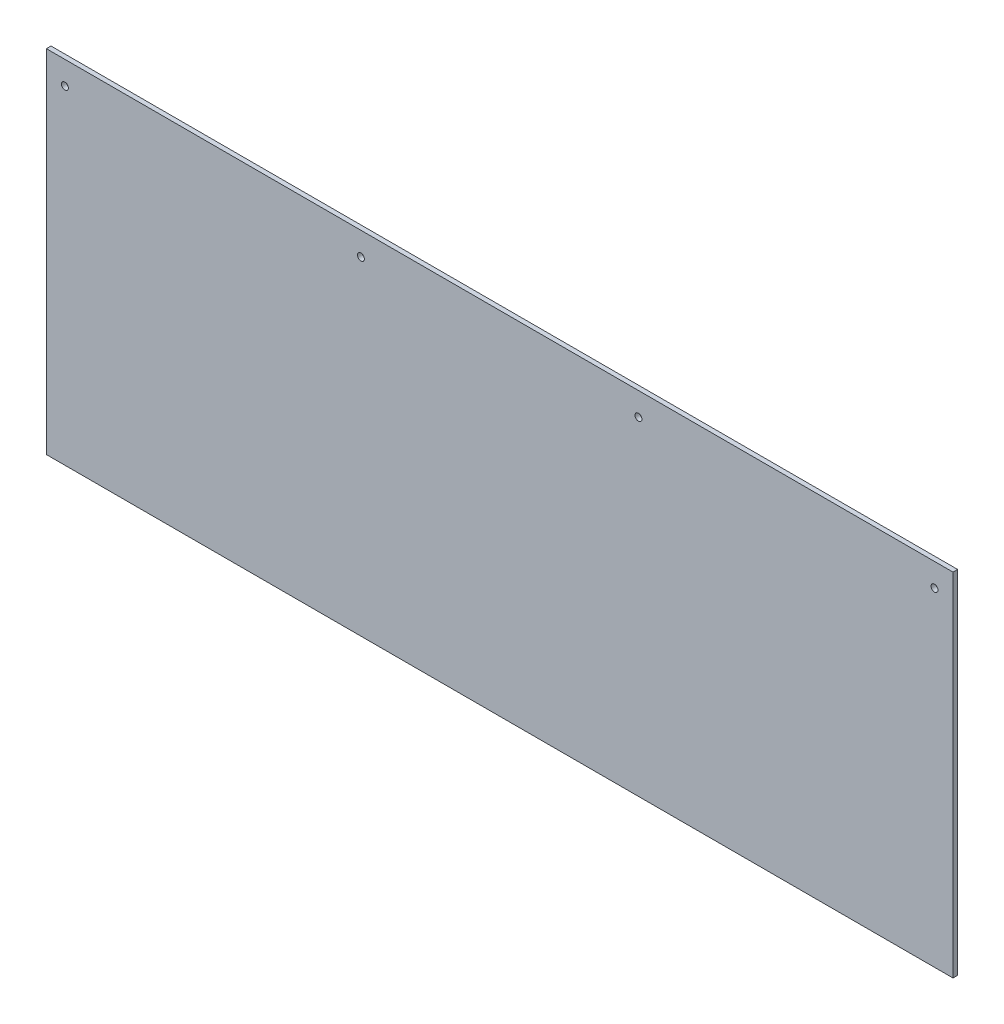
ISO-10303-21;
HEADER;
FILE_DESCRIPTION(('STEP AP214'),'2;1');
FILE_NAME('part.step','',(''),(''),'','','');
FILE_SCHEMA(('AUTOMOTIVE_DESIGN { 1 0 10303 214 1 1 1 1 }'));
ENDSEC;
DATA;
#1=APPLICATION_CONTEXT('core data for automotive mechanical design processes');
#2=APPLICATION_PROTOCOL_DEFINITION('international standard','automotive_design',2000,#1);
#3=PRODUCT_CONTEXT('',#1,'mechanical');
#4=PRODUCT('Part','Part','',(#3));
#5=PRODUCT_RELATED_PRODUCT_CATEGORY('part','',(#4));
#6=PRODUCT_DEFINITION_FORMATION('','',#4);
#7=PRODUCT_DEFINITION_CONTEXT('part definition',#1,'design');
#8=PRODUCT_DEFINITION('design','',#6,#7);
#9=PRODUCT_DEFINITION_SHAPE('','',#8);
#10=(LENGTH_UNIT() NAMED_UNIT(*) SI_UNIT(.MILLI.,.METRE.));
#11=(NAMED_UNIT(*) PLANE_ANGLE_UNIT() SI_UNIT($,.RADIAN.));
#12=(NAMED_UNIT(*) SI_UNIT($,.STERADIAN.) SOLID_ANGLE_UNIT());
#13=UNCERTAINTY_MEASURE_WITH_UNIT(LENGTH_MEASURE(1.E-05),#10,'distance_accuracy_value','');
#14=(GEOMETRIC_REPRESENTATION_CONTEXT(3) GLOBAL_UNCERTAINTY_ASSIGNED_CONTEXT((#13)) GLOBAL_UNIT_ASSIGNED_CONTEXT((#10,
#11,#12)) REPRESENTATION_CONTEXT('',''));
#15=CARTESIAN_POINT('',(0.,0.,0.));
#16=DIRECTION('',(0.,0.,1.));
#17=DIRECTION('',(1.,0.,0.));
#18=AXIS2_PLACEMENT_3D('',#15,#16,#17);
#19=CARTESIAN_POINT('',(0.,0.,6.35));
#20=DIRECTION('',(1.,0.,0.));
#21=DIRECTION('',(0.,0.,-1.));
#22=AXIS2_PLACEMENT_3D('',#19,#20,#21);
#23=PLANE('',#22);
#24=DIRECTION('',(0.,-1.,0.));
#25=VECTOR('',#24,1.);
#26=CARTESIAN_POINT('',(0.,0.,0.));
#27=LINE('',#26,#25);
#28=CARTESIAN_POINT('',(0.,482.6,0.));
#29=VERTEX_POINT('',#28);
#30=CARTESIAN_POINT('',(0.,0.,0.));
#31=VERTEX_POINT('',#30);
#32=EDGE_CURVE('E100',#29,#31,#27,.T.);
#33=ORIENTED_EDGE('',*,*,#32,.T.);
#34=DIRECTION('',(0.,0.,-1.));
#35=VECTOR('',#34,1.);
#36=CARTESIAN_POINT('',(0.,0.,6.35));
#37=LINE('',#36,#35);
#38=CARTESIAN_POINT('',(0.,0.,6.35));
#39=VERTEX_POINT('',#38);
#40=EDGE_CURVE('E11',#39,#31,#37,.T.);
#41=ORIENTED_EDGE('',*,*,#40,.F.);
#42=DIRECTION('',(0.,-1.,0.));
#43=VECTOR('',#42,1.);
#44=CARTESIAN_POINT('',(0.,0.,6.35));
#45=LINE('',#44,#43);
#46=CARTESIAN_POINT('',(0.,482.6,6.35));
#47=VERTEX_POINT('',#46);
#48=EDGE_CURVE('E88',#47,#39,#45,.T.);
#49=ORIENTED_EDGE('',*,*,#48,.F.);
#50=DIRECTION('',(0.,0.,-1.));
#51=VECTOR('',#50,1.);
#52=CARTESIAN_POINT('',(0.,482.6,6.35));
#53=LINE('',#52,#51);
#54=EDGE_CURVE('E96',#47,#29,#53,.T.);
#55=ORIENTED_EDGE('',*,*,#54,.T.);
#56=EDGE_LOOP('',(#33,#41,#49,#55));
#57=FACE_BOUND('',#56,.T.);
#58=ADVANCED_FACE('F37',(#57),#23,.F.);
#59=CARTESIAN_POINT('',(0.,0.,6.35));
#60=DIRECTION('',(0.,1.,0.));
#61=DIRECTION('',(0.,0.,1.));
#62=AXIS2_PLACEMENT_3D('',#59,#60,#61);
#63=PLANE('',#62);
#64=DIRECTION('',(1.,0.,0.));
#65=VECTOR('',#64,1.);
#66=CARTESIAN_POINT('',(0.,0.,0.));
#67=LINE('',#66,#65);
#68=CARTESIAN_POINT('',(1244.6,0.,0.));
#69=VERTEX_POINT('',#68);
#70=EDGE_CURVE('E92',#31,#69,#67,.T.);
#71=ORIENTED_EDGE('',*,*,#70,.T.);
#72=DIRECTION('',(0.,0.,-1.));
#73=VECTOR('',#72,1.);
#74=CARTESIAN_POINT('',(1244.6,0.,6.35));
#75=LINE('',#74,#73);
#76=CARTESIAN_POINT('',(1244.6,0.,6.35));
#77=VERTEX_POINT('',#76);
#78=EDGE_CURVE('E45',#77,#69,#75,.T.);
#79=ORIENTED_EDGE('',*,*,#78,.F.);
#80=DIRECTION('',(1.,0.,0.));
#81=VECTOR('',#80,1.);
#82=CARTESIAN_POINT('',(0.,0.,6.35));
#83=LINE('',#82,#81);
#84=EDGE_CURVE('E83',#39,#77,#83,.T.);
#85=ORIENTED_EDGE('',*,*,#84,.F.);
#86=ORIENTED_EDGE('',*,*,#40,.T.);
#87=EDGE_LOOP('',(#71,#79,#85,#86));
#88=FACE_BOUND('',#87,.T.);
#89=ADVANCED_FACE('F91',(#88),#63,.F.);
#90=CARTESIAN_POINT('',(1244.6,0.,6.35));
#91=DIRECTION('',(-1.,0.,0.));
#92=DIRECTION('',(0.,0.,1.));
#93=AXIS2_PLACEMENT_3D('',#90,#91,#92);
#94=PLANE('',#93);
#95=DIRECTION('',(0.,1.,0.));
#96=VECTOR('',#95,1.);
#97=CARTESIAN_POINT('',(1244.6,0.,0.));
#98=LINE('',#97,#96);
#99=CARTESIAN_POINT('',(1244.6,482.6,0.));
#100=VERTEX_POINT('',#99);
#101=EDGE_CURVE('E70',#69,#100,#98,.T.);
#102=ORIENTED_EDGE('',*,*,#101,.T.);
#103=DIRECTION('',(0.,0.,-1.));
#104=VECTOR('',#103,1.);
#105=CARTESIAN_POINT('',(1244.6,482.6,6.35));
#106=LINE('',#105,#104);
#107=CARTESIAN_POINT('',(1244.6,482.6,6.35));
#108=VERTEX_POINT('',#107);
#109=EDGE_CURVE('E93',#108,#100,#106,.T.);
#110=ORIENTED_EDGE('',*,*,#109,.F.);
#111=DIRECTION('',(0.,1.,0.));
#112=VECTOR('',#111,1.);
#113=CARTESIAN_POINT('',(1244.6,0.,6.35));
#114=LINE('',#113,#112);
#115=EDGE_CURVE('E86',#77,#108,#114,.T.);
#116=ORIENTED_EDGE('',*,*,#115,.F.);
#117=ORIENTED_EDGE('',*,*,#78,.T.);
#118=EDGE_LOOP('',(#102,#110,#116,#117));
#119=FACE_BOUND('',#118,.T.);
#120=ADVANCED_FACE('F94',(#119),#94,.F.);
#121=CARTESIAN_POINT('',(0.,482.6,6.35));
#122=DIRECTION('',(0.,-1.,0.));
#123=DIRECTION('',(1.,0.,0.));
#124=AXIS2_PLACEMENT_3D('',#121,#122,#123);
#125=PLANE('',#124);
#126=DIRECTION('',(-1.,0.,0.));
#127=VECTOR('',#126,1.);
#128=CARTESIAN_POINT('',(0.,482.6,0.));
#129=LINE('',#128,#127);
#130=EDGE_CURVE('E76',#100,#29,#129,.T.);
#131=ORIENTED_EDGE('',*,*,#130,.T.);
#132=ORIENTED_EDGE('',*,*,#54,.F.);
#133=DIRECTION('',(-1.,0.,0.));
#134=VECTOR('',#133,1.);
#135=CARTESIAN_POINT('',(0.,482.6,6.35));
#136=LINE('',#135,#134);
#137=EDGE_CURVE('E53',#108,#47,#136,.T.);
#138=ORIENTED_EDGE('',*,*,#137,.F.);
#139=ORIENTED_EDGE('',*,*,#109,.T.);
#140=EDGE_LOOP('',(#131,#132,#138,#139));
#141=FACE_BOUND('',#140,.T.);
#142=ADVANCED_FACE('F108',(#141),#125,.F.);
#143=CARTESIAN_POINT('',(0.,0.,6.35));
#144=DIRECTION('',(0.,0.,-1.));
#145=DIRECTION('',(-1.,0.,0.));
#146=AXIS2_PLACEMENT_3D('',#143,#144,#145);
#147=PLANE('',#146);
#148=CARTESIAN_POINT('',(25.4,450.85,6.35));
#149=DIRECTION('',(0.,0.,1.));
#150=DIRECTION('',(1.,0.,0.));
#151=AXIS2_PLACEMENT_3D('',#148,#149,#150);
#152=CIRCLE('',#151,4.7625);
#153=CARTESIAN_POINT('',(30.1625,450.85,6.35));
#154=VERTEX_POINT('',#153);
#155=EDGE_CURVE('E132',#154,#154,#152,.T.);
#156=ORIENTED_EDGE('',*,*,#155,.F.);
#157=EDGE_LOOP('',(#156));
#158=FACE_BOUND('',#157,.T.);
#159=CARTESIAN_POINT('',(431.8,450.85,6.35));
#160=DIRECTION('',(0.,0.,1.));
#161=DIRECTION('',(1.,0.,0.));
#162=AXIS2_PLACEMENT_3D('',#159,#160,#161);
#163=CIRCLE('',#162,4.76250000000001);
#164=CARTESIAN_POINT('',(436.5625,450.85,6.35));
#165=VERTEX_POINT('',#164);
#166=EDGE_CURVE('E126',#165,#165,#163,.T.);
#167=ORIENTED_EDGE('',*,*,#166,.F.);
#168=EDGE_LOOP('',(#167));
#169=FACE_BOUND('',#168,.T.);
#170=CARTESIAN_POINT('',(812.8,450.85,6.35));
#171=DIRECTION('',(0.,0.,1.));
#172=DIRECTION('',(1.,0.,0.));
#173=AXIS2_PLACEMENT_3D('',#170,#171,#172);
#174=CIRCLE('',#173,4.76250000000001);
#175=CARTESIAN_POINT('',(817.5625,450.85,6.35));
#176=VERTEX_POINT('',#175);
#177=EDGE_CURVE('E120',#176,#176,#174,.T.);
#178=ORIENTED_EDGE('',*,*,#177,.F.);
#179=EDGE_LOOP('',(#178));
#180=FACE_BOUND('',#179,.T.);
#181=CARTESIAN_POINT('',(1219.2,450.85,6.35));
#182=DIRECTION('',(0.,0.,1.));
#183=DIRECTION('',(1.,0.,0.));
#184=AXIS2_PLACEMENT_3D('',#181,#182,#183);
#185=CIRCLE('',#184,4.7624999999999);
#186=CARTESIAN_POINT('',(1223.9625,450.85,6.35));
#187=VERTEX_POINT('',#186);
#188=EDGE_CURVE('E114',#187,#187,#185,.T.);
#189=ORIENTED_EDGE('',*,*,#188,.F.);
#190=EDGE_LOOP('',(#189));
#191=FACE_BOUND('',#190,.T.);
#192=ORIENTED_EDGE('',*,*,#48,.T.);
#193=ORIENTED_EDGE('',*,*,#84,.T.);
#194=ORIENTED_EDGE('',*,*,#115,.T.);
#195=ORIENTED_EDGE('',*,*,#137,.T.);
#196=EDGE_LOOP('',(#192,#193,#194,#195));
#197=FACE_BOUND('',#196,.T.);
#198=ADVANCED_FACE('F84',(#158,#169,#180,#191,#197),#147,.F.);
#199=CARTESIAN_POINT('',(0.,0.,0.));
#200=DIRECTION('',(0.,0.,-1.));
#201=DIRECTION('',(-1.,0.,0.));
#202=AXIS2_PLACEMENT_3D('',#199,#200,#201);
#203=PLANE('',#202);
#204=CARTESIAN_POINT('',(25.4,450.85,0.));
#205=DIRECTION('',(0.,0.,1.));
#206=DIRECTION('',(1.,0.,0.));
#207=AXIS2_PLACEMENT_3D('',#204,#205,#206);
#208=CIRCLE('',#207,4.7625);
#209=CARTESIAN_POINT('',(30.1625,450.85,0.));
#210=VERTEX_POINT('',#209);
#211=EDGE_CURVE('E103',#210,#210,#208,.T.);
#212=ORIENTED_EDGE('',*,*,#211,.T.);
#213=EDGE_LOOP('',(#212));
#214=FACE_BOUND('',#213,.T.);
#215=CARTESIAN_POINT('',(431.8,450.85,0.));
#216=DIRECTION('',(0.,0.,1.));
#217=DIRECTION('',(1.,0.,0.));
#218=AXIS2_PLACEMENT_3D('',#215,#216,#217);
#219=CIRCLE('',#218,4.76250000000001);
#220=CARTESIAN_POINT('',(436.5625,450.85,0.));
#221=VERTEX_POINT('',#220);
#222=EDGE_CURVE('E129',#221,#221,#219,.T.);
#223=ORIENTED_EDGE('',*,*,#222,.T.);
#224=EDGE_LOOP('',(#223));
#225=FACE_BOUND('',#224,.T.);
#226=CARTESIAN_POINT('',(812.8,450.85,0.));
#227=DIRECTION('',(0.,0.,1.));
#228=DIRECTION('',(1.,0.,0.));
#229=AXIS2_PLACEMENT_3D('',#226,#227,#228);
#230=CIRCLE('',#229,4.76250000000001);
#231=CARTESIAN_POINT('',(817.5625,450.85,0.));
#232=VERTEX_POINT('',#231);
#233=EDGE_CURVE('E123',#232,#232,#230,.T.);
#234=ORIENTED_EDGE('',*,*,#233,.T.);
#235=EDGE_LOOP('',(#234));
#236=FACE_BOUND('',#235,.T.);
#237=CARTESIAN_POINT('',(1219.2,450.85,0.));
#238=DIRECTION('',(0.,0.,1.));
#239=DIRECTION('',(1.,0.,0.));
#240=AXIS2_PLACEMENT_3D('',#237,#238,#239);
#241=CIRCLE('',#240,4.7624999999999);
#242=CARTESIAN_POINT('',(1223.9625,450.85,0.));
#243=VERTEX_POINT('',#242);
#244=EDGE_CURVE('E117',#243,#243,#241,.T.);
#245=ORIENTED_EDGE('',*,*,#244,.T.);
#246=EDGE_LOOP('',(#245));
#247=FACE_BOUND('',#246,.T.);
#248=ORIENTED_EDGE('',*,*,#32,.F.);
#249=ORIENTED_EDGE('',*,*,#130,.F.);
#250=ORIENTED_EDGE('',*,*,#101,.F.);
#251=ORIENTED_EDGE('',*,*,#70,.F.);
#252=EDGE_LOOP('',(#248,#249,#250,#251));
#253=FACE_BOUND('',#252,.T.);
#254=ADVANCED_FACE('F111',(#214,#225,#236,#247,#253),#203,.T.);
#255=CARTESIAN_POINT('',(1219.2,450.85,0.));
#256=DIRECTION('',(0.,0.,1.));
#257=DIRECTION('',(1.,0.,0.));
#258=AXIS2_PLACEMENT_3D('',#255,#256,#257);
#259=CYLINDRICAL_SURFACE('',#258,4.7624999999999);
#260=ORIENTED_EDGE('',*,*,#244,.F.);
#261=EDGE_LOOP('',(#260));
#262=FACE_BOUND('',#261,.T.);
#263=ORIENTED_EDGE('',*,*,#188,.T.);
#264=EDGE_LOOP('',(#263));
#265=FACE_BOUND('',#264,.T.);
#266=ADVANCED_FACE('F156',(#262,#265),#259,.F.);
#267=CARTESIAN_POINT('',(812.8,450.85,0.));
#268=DIRECTION('',(0.,0.,1.));
#269=DIRECTION('',(1.,0.,0.));
#270=AXIS2_PLACEMENT_3D('',#267,#268,#269);
#271=CYLINDRICAL_SURFACE('',#270,4.76250000000001);
#272=ORIENTED_EDGE('',*,*,#233,.F.);
#273=EDGE_LOOP('',(#272));
#274=FACE_BOUND('',#273,.T.);
#275=ORIENTED_EDGE('',*,*,#177,.T.);
#276=EDGE_LOOP('',(#275));
#277=FACE_BOUND('',#276,.T.);
#278=ADVANCED_FACE('F158',(#274,#277),#271,.F.);
#279=CARTESIAN_POINT('',(431.8,450.85,0.));
#280=DIRECTION('',(0.,0.,1.));
#281=DIRECTION('',(1.,0.,0.));
#282=AXIS2_PLACEMENT_3D('',#279,#280,#281);
#283=CYLINDRICAL_SURFACE('',#282,4.76250000000001);
#284=ORIENTED_EDGE('',*,*,#222,.F.);
#285=EDGE_LOOP('',(#284));
#286=FACE_BOUND('',#285,.T.);
#287=ORIENTED_EDGE('',*,*,#166,.T.);
#288=EDGE_LOOP('',(#287));
#289=FACE_BOUND('',#288,.T.);
#290=ADVANCED_FACE('F143',(#286,#289),#283,.F.);
#291=CARTESIAN_POINT('',(25.4,450.85,0.));
#292=DIRECTION('',(0.,0.,1.));
#293=DIRECTION('',(1.,0.,0.));
#294=AXIS2_PLACEMENT_3D('',#291,#292,#293);
#295=CYLINDRICAL_SURFACE('',#294,4.7625);
#296=ORIENTED_EDGE('',*,*,#211,.F.);
#297=EDGE_LOOP('',(#296));
#298=FACE_BOUND('',#297,.T.);
#299=ORIENTED_EDGE('',*,*,#155,.T.);
#300=EDGE_LOOP('',(#299));
#301=FACE_BOUND('',#300,.T.);
#302=ADVANCED_FACE('F140',(#298,#301),#295,.F.);
#303=CLOSED_SHELL('',(#58,#89,#120,#142,#198,#254,#266,#278,#290,#302));
#304=MANIFOLD_SOLID_BREP('B2',#303);
#305=ADVANCED_BREP_SHAPE_REPRESENTATION('',(#18,#304),#14);
#306=SHAPE_DEFINITION_REPRESENTATION(#9,#305);
ENDSEC;
END-ISO-10303-21;
